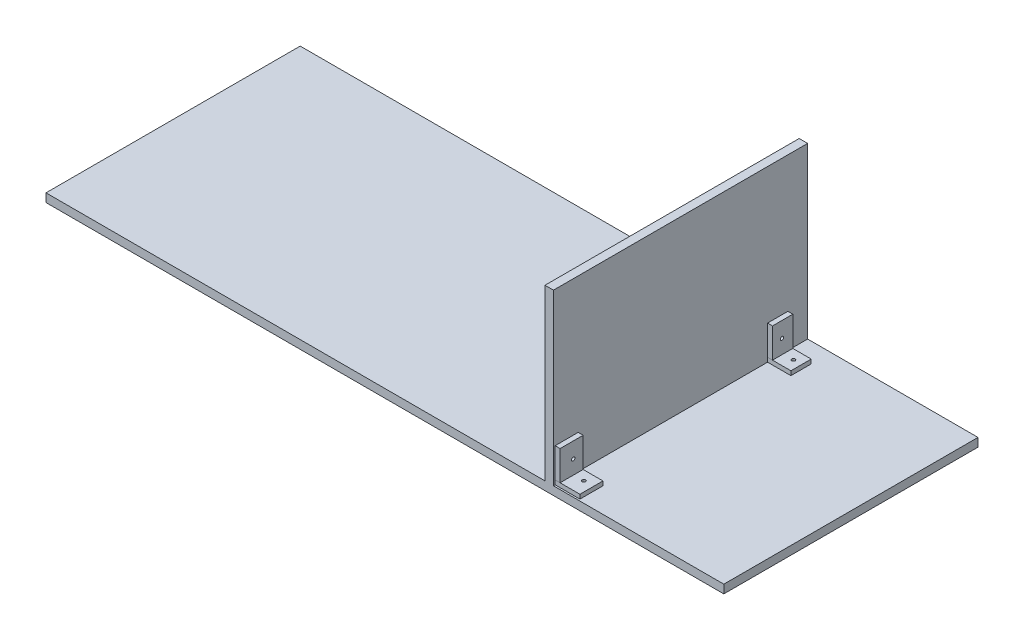
ISO-10303-21;
HEADER;
FILE_DESCRIPTION(('STEP AP214'),'2;1');
FILE_NAME('part.step','',(''),(''),'','','');
FILE_SCHEMA(('AUTOMOTIVE_DESIGN { 1 0 10303 214 1 1 1 1 }'));
ENDSEC;
DATA;
#1=APPLICATION_CONTEXT('core data for automotive mechanical design processes');
#2=APPLICATION_PROTOCOL_DEFINITION('international standard','automotive_design',2000,#1);
#3=PRODUCT_CONTEXT('',#1,'mechanical');
#4=PRODUCT('Part','Part','',(#3));
#5=PRODUCT_RELATED_PRODUCT_CATEGORY('part','',(#4));
#6=PRODUCT_DEFINITION_FORMATION('','',#4);
#7=PRODUCT_DEFINITION_CONTEXT('part definition',#1,'design');
#8=PRODUCT_DEFINITION('design','',#6,#7);
#9=PRODUCT_DEFINITION_SHAPE('','',#8);
#10=(LENGTH_UNIT() NAMED_UNIT(*) SI_UNIT(.MILLI.,.METRE.));
#11=(NAMED_UNIT(*) PLANE_ANGLE_UNIT() SI_UNIT($,.RADIAN.));
#12=(NAMED_UNIT(*) SI_UNIT($,.STERADIAN.) SOLID_ANGLE_UNIT());
#13=UNCERTAINTY_MEASURE_WITH_UNIT(LENGTH_MEASURE(1.E-05),#10,'distance_accuracy_value','');
#14=(GEOMETRIC_REPRESENTATION_CONTEXT(3) GLOBAL_UNCERTAINTY_ASSIGNED_CONTEXT((#13)) GLOBAL_UNIT_ASSIGNED_CONTEXT((#10,
#11,#12)) REPRESENTATION_CONTEXT('',''));
#15=CARTESIAN_POINT('',(0.,0.,0.));
#16=DIRECTION('',(0.,0.,1.));
#17=DIRECTION('',(1.,0.,0.));
#18=AXIS2_PLACEMENT_3D('',#15,#16,#17);
#19=CARTESIAN_POINT('',(-36.5676342908523,50.,-114.279683456061));
#20=DIRECTION('',(1.,0.,0.));
#21=DIRECTION('',(0.,0.,-1.));
#22=AXIS2_PLACEMENT_3D('',#19,#20,#21);
#23=PLANE('',#22);
#24=CARTESIAN_POINT('',(-36.5676342908523,31.6172761758651,-125.47551964991));
#25=DIRECTION('',(1.,0.,0.));
#26=DIRECTION('',(0.,0.,-1.));
#27=AXIS2_PLACEMENT_3D('',#24,#25,#26);
#28=CIRCLE('',#27,1.99999999999991);
#29=CARTESIAN_POINT('',(-36.5676342908523,31.6172761758651,-127.47551964991));
#30=VERTEX_POINT('',#29);
#31=EDGE_CURVE('E110',#30,#30,#28,.T.);
#32=ORIENTED_EDGE('',*,*,#31,.T.);
#33=EDGE_LOOP('',(#32));
#34=FACE_BOUND('',#33,.T.);
#35=DIRECTION('',(0.,0.,1.));
#36=VECTOR('',#35,1.);
#37=CARTESIAN_POINT('',(-36.5676342908523,15.,-114.279683456061));
#38=LINE('',#37,#36);
#39=CARTESIAN_POINT('',(-36.5676342908523,15.,-138.223579020959));
#40=VERTEX_POINT('',#39);
#41=CARTESIAN_POINT('',(-36.5676342908523,15.,-114.279683456061));
#42=VERTEX_POINT('',#41);
#43=EDGE_CURVE('E107',#40,#42,#38,.T.);
#44=ORIENTED_EDGE('',*,*,#43,.T.);
#45=DIRECTION('',(0.,-1.,0.));
#46=VECTOR('',#45,1.);
#47=CARTESIAN_POINT('',(-36.5676342908523,50.,-114.279683456061));
#48=LINE('',#47,#46);
#49=CARTESIAN_POINT('',(-36.5676342908523,50.,-114.279683456061));
#50=VERTEX_POINT('',#49);
#51=EDGE_CURVE('E12',#50,#42,#48,.T.);
#52=ORIENTED_EDGE('',*,*,#51,.F.);
#53=DIRECTION('',(0.,0.,1.));
#54=VECTOR('',#53,1.);
#55=CARTESIAN_POINT('',(-36.5676342908523,50.,-114.279683456061));
#56=LINE('',#55,#54);
#57=CARTESIAN_POINT('',(-36.5676342908523,50.,-138.223579020959));
#58=VERTEX_POINT('',#57);
#59=EDGE_CURVE('E95',#58,#50,#56,.T.);
#60=ORIENTED_EDGE('',*,*,#59,.F.);
#61=DIRECTION('',(0.,-1.,0.));
#62=VECTOR('',#61,1.);
#63=CARTESIAN_POINT('',(-36.5676342908523,50.,-138.223579020959));
#64=LINE('',#63,#62);
#65=EDGE_CURVE('E103',#58,#40,#64,.T.);
#66=ORIENTED_EDGE('',*,*,#65,.T.);
#67=EDGE_LOOP('',(#44,#52,#60,#66));
#68=FACE_BOUND('',#67,.T.);
#69=ADVANCED_FACE('F44',(#34,#68),#23,.F.);
#70=CARTESIAN_POINT('',(-36.5676342908523,50.,-114.279683456061));
#71=DIRECTION('',(0.,0.,-1.));
#72=DIRECTION('',(-1.,0.,0.));
#73=AXIS2_PLACEMENT_3D('',#70,#71,#72);
#74=PLANE('',#73);
#75=DIRECTION('',(1.,0.,0.));
#76=VECTOR('',#75,1.);
#77=CARTESIAN_POINT('',(-36.5676342908523,15.,-114.279683456061));
#78=LINE('',#77,#76);
#79=CARTESIAN_POINT('',(-30.7388499597323,15.,-114.279683456061));
#80=VERTEX_POINT('',#79);
#81=EDGE_CURVE('E99',#42,#80,#78,.T.);
#82=ORIENTED_EDGE('',*,*,#81,.T.);
#83=DIRECTION('',(0.,-1.,0.));
#84=VECTOR('',#83,1.);
#85=CARTESIAN_POINT('',(-30.7388499597323,50.,-114.279683456061));
#86=LINE('',#85,#84);
#87=CARTESIAN_POINT('',(-30.7388499597323,50.,-114.279683456061));
#88=VERTEX_POINT('',#87);
#89=EDGE_CURVE('E52',#88,#80,#86,.T.);
#90=ORIENTED_EDGE('',*,*,#89,.F.);
#91=DIRECTION('',(1.,0.,0.));
#92=VECTOR('',#91,1.);
#93=CARTESIAN_POINT('',(-36.5676342908523,50.,-114.279683456061));
#94=LINE('',#93,#92);
#95=EDGE_CURVE('E90',#50,#88,#94,.T.);
#96=ORIENTED_EDGE('',*,*,#95,.F.);
#97=ORIENTED_EDGE('',*,*,#51,.T.);
#98=EDGE_LOOP('',(#82,#90,#96,#97));
#99=FACE_BOUND('',#98,.T.);
#100=ADVANCED_FACE('F98',(#99),#74,.F.);
#101=CARTESIAN_POINT('',(-30.7388499597323,50.,-114.279683456061));
#102=DIRECTION('',(-1.,0.,0.));
#103=DIRECTION('',(0.,0.,1.));
#104=AXIS2_PLACEMENT_3D('',#101,#102,#103);
#105=PLANE('',#104);
#106=CARTESIAN_POINT('',(-30.7388499597323,31.6172761758651,-125.47551964991));
#107=DIRECTION('',(1.,0.,0.));
#108=DIRECTION('',(0.,0.,-1.));
#109=AXIS2_PLACEMENT_3D('',#106,#107,#108);
#110=CIRCLE('',#109,1.99999999999999);
#111=CARTESIAN_POINT('',(-30.7388499597323,31.6172761758651,-127.47551964991));
#112=VERTEX_POINT('',#111);
#113=EDGE_CURVE('E123',#112,#112,#110,.T.);
#114=ORIENTED_EDGE('',*,*,#113,.F.);
#115=EDGE_LOOP('',(#114));
#116=FACE_BOUND('',#115,.T.);
#117=DIRECTION('',(0.,0.,-1.));
#118=VECTOR('',#117,1.);
#119=CARTESIAN_POINT('',(-30.7388499597323,15.,-114.279683456061));
#120=LINE('',#119,#118);
#121=CARTESIAN_POINT('',(-30.7388499597323,15.,-138.223579020959));
#122=VERTEX_POINT('',#121);
#123=EDGE_CURVE('E77',#80,#122,#120,.T.);
#124=ORIENTED_EDGE('',*,*,#123,.T.);
#125=DIRECTION('',(0.,-1.,0.));
#126=VECTOR('',#125,1.);
#127=CARTESIAN_POINT('',(-30.7388499597323,50.,-138.223579020959));
#128=LINE('',#127,#126);
#129=CARTESIAN_POINT('',(-30.7388499597323,50.,-138.223579020959));
#130=VERTEX_POINT('',#129);
#131=EDGE_CURVE('E100',#130,#122,#128,.T.);
#132=ORIENTED_EDGE('',*,*,#131,.F.);
#133=DIRECTION('',(0.,0.,-1.));
#134=VECTOR('',#133,1.);
#135=CARTESIAN_POINT('',(-30.7388499597323,50.,-114.279683456061));
#136=LINE('',#135,#134);
#137=EDGE_CURVE('E93',#88,#130,#136,.T.);
#138=ORIENTED_EDGE('',*,*,#137,.F.);
#139=ORIENTED_EDGE('',*,*,#89,.T.);
#140=EDGE_LOOP('',(#124,#132,#138,#139));
#141=FACE_BOUND('',#140,.T.);
#142=ADVANCED_FACE('F101',(#116,#141),#105,.F.);
#143=CARTESIAN_POINT('',(-36.5676342908523,50.,-138.223579020959));
#144=DIRECTION('',(0.,0.,1.));
#145=DIRECTION('',(1.,0.,0.));
#146=AXIS2_PLACEMENT_3D('',#143,#144,#145);
#147=PLANE('',#146);
#148=DIRECTION('',(-1.,0.,0.));
#149=VECTOR('',#148,1.);
#150=CARTESIAN_POINT('',(-36.5676342908523,15.,-138.223579020959));
#151=LINE('',#150,#149);
#152=EDGE_CURVE('E83',#122,#40,#151,.T.);
#153=ORIENTED_EDGE('',*,*,#152,.T.);
#154=ORIENTED_EDGE('',*,*,#65,.F.);
#155=DIRECTION('',(-1.,0.,0.));
#156=VECTOR('',#155,1.);
#157=CARTESIAN_POINT('',(-36.5676342908523,50.,-138.223579020959));
#158=LINE('',#157,#156);
#159=EDGE_CURVE('E60',#130,#58,#158,.T.);
#160=ORIENTED_EDGE('',*,*,#159,.F.);
#161=ORIENTED_EDGE('',*,*,#131,.T.);
#162=EDGE_LOOP('',(#153,#154,#160,#161));
#163=FACE_BOUND('',#162,.T.);
#164=ADVANCED_FACE('F115',(#163),#147,.F.);
#165=CARTESIAN_POINT('',(0.,50.,0.));
#166=DIRECTION('',(0.,-1.,0.));
#167=DIRECTION('',(0.,0.,-1.));
#168=AXIS2_PLACEMENT_3D('',#165,#166,#167);
#169=PLANE('',#168);
#170=ORIENTED_EDGE('',*,*,#59,.T.);
#171=ORIENTED_EDGE('',*,*,#95,.T.);
#172=ORIENTED_EDGE('',*,*,#137,.T.);
#173=ORIENTED_EDGE('',*,*,#159,.T.);
#174=EDGE_LOOP('',(#170,#171,#172,#173));
#175=FACE_BOUND('',#174,.T.);
#176=ADVANCED_FACE('F91',(#175),#169,.F.);
#177=CARTESIAN_POINT('',(0.,15.,0.));
#178=DIRECTION('',(0.,-1.,0.));
#179=DIRECTION('',(0.,0.,-1.));
#180=AXIS2_PLACEMENT_3D('',#177,#178,#179);
#181=PLANE('',#180);
#182=ORIENTED_EDGE('',*,*,#43,.F.);
#183=ORIENTED_EDGE('',*,*,#152,.F.);
#184=ORIENTED_EDGE('',*,*,#123,.F.);
#185=ORIENTED_EDGE('',*,*,#81,.F.);
#186=EDGE_LOOP('',(#182,#183,#184,#185));
#187=FACE_BOUND('',#186,.T.);
#188=ADVANCED_FACE('F118',(#187),#181,.T.);
#189=CARTESIAN_POINT('',(-30.7388499597323,31.6172761758651,-125.47551964991));
#190=DIRECTION('',(1.,0.,0.));
#191=DIRECTION('',(0.,0.,-1.));
#192=AXIS2_PLACEMENT_3D('',#189,#190,#191);
#193=CYLINDRICAL_SURFACE('',#192,1.99999999999991);
#194=ORIENTED_EDGE('',*,*,#113,.T.);
#195=EDGE_LOOP('',(#194));
#196=FACE_BOUND('',#195,.T.);
#197=ORIENTED_EDGE('',*,*,#31,.F.);
#198=EDGE_LOOP('',(#197));
#199=FACE_BOUND('',#198,.T.);
#200=ADVANCED_FACE('F127',(#196,#199),#193,.F.);
#201=CLOSED_SHELL('',(#69,#100,#142,#164,#176,#188,#200));
#202=MANIFOLD_SOLID_BREP('B2',#201);
#203=CARTESIAN_POINT('',(-36.5676342908523,50.,136.415393086125));
#204=DIRECTION('',(1.,0.,0.));
#205=DIRECTION('',(0.,0.,-1.));
#206=AXIS2_PLACEMENT_3D('',#203,#204,#205);
#207=PLANE('',#206);
#208=CARTESIAN_POINT('',(-36.5676342908523,31.6172761758651,120.917654542936));
#209=DIRECTION('',(1.,0.,0.));
#210=DIRECTION('',(0.,0.,-1.));
#211=AXIS2_PLACEMENT_3D('',#208,#209,#210);
#212=CIRCLE('',#211,1.99999999999991);
#213=CARTESIAN_POINT('',(-36.5676342908523,31.6172761758651,118.917654542936));
#214=VERTEX_POINT('',#213);
#215=EDGE_CURVE('E265',#214,#214,#212,.T.);
#216=ORIENTED_EDGE('',*,*,#215,.T.);
#217=EDGE_LOOP('',(#216));
#218=FACE_BOUND('',#217,.T.);
#219=DIRECTION('',(0.,0.,1.));
#220=VECTOR('',#219,1.);
#221=CARTESIAN_POINT('',(-36.5676342908523,15.,136.415393086125));
#222=LINE('',#221,#220);
#223=CARTESIAN_POINT('',(-36.5676342908523,15.,109.22857214905));
#224=VERTEX_POINT('',#223);
#225=CARTESIAN_POINT('',(-36.5676342908523,15.,136.415393086125));
#226=VERTEX_POINT('',#225);
#227=EDGE_CURVE('E262',#224,#226,#222,.T.);
#228=ORIENTED_EDGE('',*,*,#227,.T.);
#229=DIRECTION('',(0.,-1.,0.));
#230=VECTOR('',#229,1.);
#231=CARTESIAN_POINT('',(-36.5676342908523,50.,136.415393086125));
#232=LINE('',#231,#230);
#233=CARTESIAN_POINT('',(-36.5676342908523,50.,136.415393086125));
#234=VERTEX_POINT('',#233);
#235=EDGE_CURVE('E42',#234,#226,#232,.T.);
#236=ORIENTED_EDGE('',*,*,#235,.F.);
#237=DIRECTION('',(0.,0.,1.));
#238=VECTOR('',#237,1.);
#239=CARTESIAN_POINT('',(-36.5676342908523,50.,136.415393086125));
#240=LINE('',#239,#238);
#241=CARTESIAN_POINT('',(-36.5676342908523,50.,109.22857214905));
#242=VERTEX_POINT('',#241);
#243=EDGE_CURVE('E250',#242,#234,#240,.T.);
#244=ORIENTED_EDGE('',*,*,#243,.F.);
#245=DIRECTION('',(0.,-1.,0.));
#246=VECTOR('',#245,1.);
#247=CARTESIAN_POINT('',(-36.5676342908523,50.,109.22857214905));
#248=LINE('',#247,#246);
#249=EDGE_CURVE('E258',#242,#224,#248,.T.);
#250=ORIENTED_EDGE('',*,*,#249,.T.);
#251=EDGE_LOOP('',(#228,#236,#244,#250));
#252=FACE_BOUND('',#251,.T.);
#253=ADVANCED_FACE('F199',(#218,#252),#207,.F.);
#254=CARTESIAN_POINT('',(-36.5676342908523,50.,136.415393086125));
#255=DIRECTION('',(0.,0.,-1.));
#256=DIRECTION('',(-1.,0.,0.));
#257=AXIS2_PLACEMENT_3D('',#254,#255,#256);
#258=PLANE('',#257);
#259=DIRECTION('',(1.,0.,0.));
#260=VECTOR('',#259,1.);
#261=CARTESIAN_POINT('',(-36.5676342908523,15.,136.415393086125));
#262=LINE('',#261,#260);
#263=CARTESIAN_POINT('',(-30.7388499597323,15.,136.415393086125));
#264=VERTEX_POINT('',#263);
#265=EDGE_CURVE('E254',#226,#264,#262,.T.);
#266=ORIENTED_EDGE('',*,*,#265,.T.);
#267=DIRECTION('',(0.,-1.,0.));
#268=VECTOR('',#267,1.);
#269=CARTESIAN_POINT('',(-30.7388499597323,50.,136.415393086125));
#270=LINE('',#269,#268);
#271=CARTESIAN_POINT('',(-30.7388499597323,50.,136.415393086125));
#272=VERTEX_POINT('',#271);
#273=EDGE_CURVE('E207',#272,#264,#270,.T.);
#274=ORIENTED_EDGE('',*,*,#273,.F.);
#275=DIRECTION('',(1.,0.,0.));
#276=VECTOR('',#275,1.);
#277=CARTESIAN_POINT('',(-36.5676342908523,50.,136.415393086125));
#278=LINE('',#277,#276);
#279=EDGE_CURVE('E245',#234,#272,#278,.T.);
#280=ORIENTED_EDGE('',*,*,#279,.F.);
#281=ORIENTED_EDGE('',*,*,#235,.T.);
#282=EDGE_LOOP('',(#266,#274,#280,#281));
#283=FACE_BOUND('',#282,.T.);
#284=ADVANCED_FACE('F253',(#283),#258,.F.);
#285=CARTESIAN_POINT('',(-30.7388499597323,50.,136.415393086125));
#286=DIRECTION('',(-1.,0.,0.));
#287=DIRECTION('',(0.,0.,1.));
#288=AXIS2_PLACEMENT_3D('',#285,#286,#287);
#289=PLANE('',#288);
#290=CARTESIAN_POINT('',(-30.7388499597323,31.6172761758651,120.917654542936));
#291=DIRECTION('',(1.,0.,0.));
#292=DIRECTION('',(0.,0.,-1.));
#293=AXIS2_PLACEMENT_3D('',#290,#291,#292);
#294=CIRCLE('',#293,1.99999999999999);
#295=CARTESIAN_POINT('',(-30.7388499597323,31.6172761758651,118.917654542936));
#296=VERTEX_POINT('',#295);
#297=EDGE_CURVE('E278',#296,#296,#294,.T.);
#298=ORIENTED_EDGE('',*,*,#297,.F.);
#299=EDGE_LOOP('',(#298));
#300=FACE_BOUND('',#299,.T.);
#301=DIRECTION('',(0.,0.,-1.));
#302=VECTOR('',#301,1.);
#303=CARTESIAN_POINT('',(-30.7388499597323,15.,136.415393086125));
#304=LINE('',#303,#302);
#305=CARTESIAN_POINT('',(-30.7388499597323,15.,109.22857214905));
#306=VERTEX_POINT('',#305);
#307=EDGE_CURVE('E232',#264,#306,#304,.T.);
#308=ORIENTED_EDGE('',*,*,#307,.T.);
#309=DIRECTION('',(0.,-1.,0.));
#310=VECTOR('',#309,1.);
#311=CARTESIAN_POINT('',(-30.7388499597323,50.,109.22857214905));
#312=LINE('',#311,#310);
#313=CARTESIAN_POINT('',(-30.7388499597323,50.,109.22857214905));
#314=VERTEX_POINT('',#313);
#315=EDGE_CURVE('E255',#314,#306,#312,.T.);
#316=ORIENTED_EDGE('',*,*,#315,.F.);
#317=DIRECTION('',(0.,0.,-1.));
#318=VECTOR('',#317,1.);
#319=CARTESIAN_POINT('',(-30.7388499597323,50.,136.415393086125));
#320=LINE('',#319,#318);
#321=EDGE_CURVE('E248',#272,#314,#320,.T.);
#322=ORIENTED_EDGE('',*,*,#321,.F.);
#323=ORIENTED_EDGE('',*,*,#273,.T.);
#324=EDGE_LOOP('',(#308,#316,#322,#323));
#325=FACE_BOUND('',#324,.T.);
#326=ADVANCED_FACE('F256',(#300,#325),#289,.F.);
#327=CARTESIAN_POINT('',(-36.5676342908523,50.,109.22857214905));
#328=DIRECTION('',(0.,0.,1.));
#329=DIRECTION('',(1.,0.,0.));
#330=AXIS2_PLACEMENT_3D('',#327,#328,#329);
#331=PLANE('',#330);
#332=DIRECTION('',(-1.,0.,0.));
#333=VECTOR('',#332,1.);
#334=CARTESIAN_POINT('',(-36.5676342908523,15.,109.22857214905));
#335=LINE('',#334,#333);
#336=EDGE_CURVE('E238',#306,#224,#335,.T.);
#337=ORIENTED_EDGE('',*,*,#336,.T.);
#338=ORIENTED_EDGE('',*,*,#249,.F.);
#339=DIRECTION('',(-1.,0.,0.));
#340=VECTOR('',#339,1.);
#341=CARTESIAN_POINT('',(-36.5676342908523,50.,109.22857214905));
#342=LINE('',#341,#340);
#343=EDGE_CURVE('E215',#314,#242,#342,.T.);
#344=ORIENTED_EDGE('',*,*,#343,.F.);
#345=ORIENTED_EDGE('',*,*,#315,.T.);
#346=EDGE_LOOP('',(#337,#338,#344,#345));
#347=FACE_BOUND('',#346,.T.);
#348=ADVANCED_FACE('F270',(#347),#331,.F.);
#349=CARTESIAN_POINT('',(0.,50.,0.));
#350=DIRECTION('',(0.,-1.,0.));
#351=DIRECTION('',(0.,0.,-1.));
#352=AXIS2_PLACEMENT_3D('',#349,#350,#351);
#353=PLANE('',#352);
#354=ORIENTED_EDGE('',*,*,#243,.T.);
#355=ORIENTED_EDGE('',*,*,#279,.T.);
#356=ORIENTED_EDGE('',*,*,#321,.T.);
#357=ORIENTED_EDGE('',*,*,#343,.T.);
#358=EDGE_LOOP('',(#354,#355,#356,#357));
#359=FACE_BOUND('',#358,.T.);
#360=ADVANCED_FACE('F246',(#359),#353,.F.);
#361=CARTESIAN_POINT('',(0.,15.,0.));
#362=DIRECTION('',(0.,-1.,0.));
#363=DIRECTION('',(0.,0.,-1.));
#364=AXIS2_PLACEMENT_3D('',#361,#362,#363);
#365=PLANE('',#364);
#366=ORIENTED_EDGE('',*,*,#227,.F.);
#367=ORIENTED_EDGE('',*,*,#336,.F.);
#368=ORIENTED_EDGE('',*,*,#307,.F.);
#369=ORIENTED_EDGE('',*,*,#265,.F.);
#370=EDGE_LOOP('',(#366,#367,#368,#369));
#371=FACE_BOUND('',#370,.T.);
#372=ADVANCED_FACE('F273',(#371),#365,.T.);
#373=CARTESIAN_POINT('',(-30.7388499597323,31.6172761758651,120.917654542936));
#374=DIRECTION('',(1.,0.,0.));
#375=DIRECTION('',(0.,0.,-1.));
#376=AXIS2_PLACEMENT_3D('',#373,#374,#375);
#377=CYLINDRICAL_SURFACE('',#376,1.99999999999991);
#378=ORIENTED_EDGE('',*,*,#297,.T.);
#379=EDGE_LOOP('',(#378));
#380=FACE_BOUND('',#379,.T.);
#381=ORIENTED_EDGE('',*,*,#215,.F.);
#382=EDGE_LOOP('',(#381));
#383=FACE_BOUND('',#382,.T.);
#384=ADVANCED_FACE('F282',(#380,#383),#377,.F.);
#385=CLOSED_SHELL('',(#253,#284,#326,#348,#360,#372,#384));
#386=MANIFOLD_SOLID_BREP('B6',#385);
#387=CARTESIAN_POINT('',(-9.03405457172823,15.,-114.279683456061));
#388=DIRECTION('',(-1.,0.,0.));
#389=DIRECTION('',(0.,0.,1.));
#390=AXIS2_PLACEMENT_3D('',#387,#388,#389);
#391=PLANE('',#390);
#392=DIRECTION('',(0.,0.,-1.));
#393=VECTOR('',#392,1.);
#394=CARTESIAN_POINT('',(-9.03405457172823,10.,-114.279683456061));
#395=LINE('',#394,#393);
#396=CARTESIAN_POINT('',(-9.03405457172823,10.,-114.279683456061));
#397=VERTEX_POINT('',#396);
#398=CARTESIAN_POINT('',(-9.03405457172823,10.,-138.223579020959));
#399=VERTEX_POINT('',#398);
#400=EDGE_CURVE('E417',#397,#399,#395,.T.);
#401=ORIENTED_EDGE('',*,*,#400,.T.);
#402=DIRECTION('',(0.,-1.,0.));
#403=VECTOR('',#402,1.);
#404=CARTESIAN_POINT('',(-9.03405457172823,15.,-138.223579020959));
#405=LINE('',#404,#403);
#406=CARTESIAN_POINT('',(-9.03405457172823,15.,-138.223579020959));
#407=VERTEX_POINT('',#406);
#408=EDGE_CURVE('E197',#407,#399,#405,.T.);
#409=ORIENTED_EDGE('',*,*,#408,.F.);
#410=DIRECTION('',(0.,0.,-1.));
#411=VECTOR('',#410,1.);
#412=CARTESIAN_POINT('',(-9.03405457172823,15.,-114.279683456061));
#413=LINE('',#412,#411);
#414=CARTESIAN_POINT('',(-9.03405457172823,15.,-114.279683456061));
#415=VERTEX_POINT('',#414);
#416=EDGE_CURVE('E405',#415,#407,#413,.T.);
#417=ORIENTED_EDGE('',*,*,#416,.F.);
#418=DIRECTION('',(0.,-1.,0.));
#419=VECTOR('',#418,1.);
#420=CARTESIAN_POINT('',(-9.03405457172823,15.,-114.279683456061));
#421=LINE('',#420,#419);
#422=EDGE_CURVE('E413',#415,#397,#421,.T.);
#423=ORIENTED_EDGE('',*,*,#422,.T.);
#424=EDGE_LOOP('',(#401,#409,#417,#423));
#425=FACE_BOUND('',#424,.T.);
#426=ADVANCED_FACE('F354',(#425),#391,.F.);
#427=CARTESIAN_POINT('',(-9.03405457172823,15.,-138.223579020959));
#428=DIRECTION('',(0.,0.,1.));
#429=DIRECTION('',(1.,0.,0.));
#430=AXIS2_PLACEMENT_3D('',#427,#428,#429);
#431=PLANE('',#430);
#432=DIRECTION('',(-1.,0.,0.));
#433=VECTOR('',#432,1.);
#434=CARTESIAN_POINT('',(-9.03405457172823,10.,-138.223579020959));
#435=LINE('',#434,#433);
#436=CARTESIAN_POINT('',(-36.5676342908523,10.,-138.223579020959));
#437=VERTEX_POINT('',#436);
#438=EDGE_CURVE('E409',#399,#437,#435,.T.);
#439=ORIENTED_EDGE('',*,*,#438,.T.);
#440=DIRECTION('',(0.,-1.,0.));
#441=VECTOR('',#440,1.);
#442=CARTESIAN_POINT('',(-36.5676342908523,15.,-138.223579020959));
#443=LINE('',#442,#441);
#444=CARTESIAN_POINT('',(-36.5676342908523,15.,-138.223579020959));
#445=VERTEX_POINT('',#444);
#446=EDGE_CURVE('E362',#445,#437,#443,.T.);
#447=ORIENTED_EDGE('',*,*,#446,.F.);
#448=DIRECTION('',(-1.,0.,0.));
#449=VECTOR('',#448,1.);
#450=CARTESIAN_POINT('',(-9.03405457172823,15.,-138.223579020959));
#451=LINE('',#450,#449);
#452=EDGE_CURVE('E400',#407,#445,#451,.T.);
#453=ORIENTED_EDGE('',*,*,#452,.F.);
#454=ORIENTED_EDGE('',*,*,#408,.T.);
#455=EDGE_LOOP('',(#439,#447,#453,#454));
#456=FACE_BOUND('',#455,.T.);
#457=ADVANCED_FACE('F408',(#456),#431,.F.);
#458=CARTESIAN_POINT('',(-36.5676342908523,15.,-114.279683456061));
#459=DIRECTION('',(1.,0.,0.));
#460=DIRECTION('',(0.,0.,-1.));
#461=AXIS2_PLACEMENT_3D('',#458,#459,#460);
#462=PLANE('',#461);
#463=DIRECTION('',(0.,0.,1.));
#464=VECTOR('',#463,1.);
#465=CARTESIAN_POINT('',(-36.5676342908523,10.,-114.279683456061));
#466=LINE('',#465,#464);
#467=CARTESIAN_POINT('',(-36.5676342908523,10.,-114.279683456061));
#468=VERTEX_POINT('',#467);
#469=EDGE_CURVE('E387',#437,#468,#466,.T.);
#470=ORIENTED_EDGE('',*,*,#469,.T.);
#471=DIRECTION('',(0.,-1.,0.));
#472=VECTOR('',#471,1.);
#473=CARTESIAN_POINT('',(-36.5676342908523,15.,-114.279683456061));
#474=LINE('',#473,#472);
#475=CARTESIAN_POINT('',(-36.5676342908523,15.,-114.279683456061));
#476=VERTEX_POINT('',#475);
#477=EDGE_CURVE('E410',#476,#468,#474,.T.);
#478=ORIENTED_EDGE('',*,*,#477,.F.);
#479=DIRECTION('',(0.,0.,1.));
#480=VECTOR('',#479,1.);
#481=CARTESIAN_POINT('',(-36.5676342908523,15.,-114.279683456061));
#482=LINE('',#481,#480);
#483=EDGE_CURVE('E403',#445,#476,#482,.T.);
#484=ORIENTED_EDGE('',*,*,#483,.F.);
#485=ORIENTED_EDGE('',*,*,#446,.T.);
#486=EDGE_LOOP('',(#470,#478,#484,#485));
#487=FACE_BOUND('',#486,.T.);
#488=ADVANCED_FACE('F411',(#487),#462,.F.);
#489=CARTESIAN_POINT('',(-9.03405457172823,15.,-114.279683456061));
#490=DIRECTION('',(0.,0.,-1.));
#491=DIRECTION('',(-1.,0.,0.));
#492=AXIS2_PLACEMENT_3D('',#489,#490,#491);
#493=PLANE('',#492);
#494=DIRECTION('',(1.,0.,0.));
#495=VECTOR('',#494,1.);
#496=CARTESIAN_POINT('',(-9.03405457172823,10.,-114.279683456061));
#497=LINE('',#496,#495);
#498=EDGE_CURVE('E393',#468,#397,#497,.T.);
#499=ORIENTED_EDGE('',*,*,#498,.T.);
#500=ORIENTED_EDGE('',*,*,#422,.F.);
#501=DIRECTION('',(1.,0.,0.));
#502=VECTOR('',#501,1.);
#503=CARTESIAN_POINT('',(-9.03405457172823,15.,-114.279683456061));
#504=LINE('',#503,#502);
#505=EDGE_CURVE('E370',#476,#415,#504,.T.);
#506=ORIENTED_EDGE('',*,*,#505,.F.);
#507=ORIENTED_EDGE('',*,*,#477,.T.);
#508=EDGE_LOOP('',(#499,#500,#506,#507));
#509=FACE_BOUND('',#508,.T.);
#510=ADVANCED_FACE('F425',(#509),#493,.F.);
#511=CARTESIAN_POINT('',(0.,15.,0.));
#512=DIRECTION('',(0.,1.,0.));
#513=DIRECTION('',(0.,0.,1.));
#514=AXIS2_PLACEMENT_3D('',#511,#512,#513);
#515=PLANE('',#514);
#516=CARTESIAN_POINT('',(-18.6879904818511,15.,-126.915842267806));
#517=DIRECTION('',(0.,1.,0.));
#518=DIRECTION('',(0.,0.,1.));
#519=AXIS2_PLACEMENT_3D('',#516,#517,#518);
#520=CIRCLE('',#519,2.);
#521=CARTESIAN_POINT('',(-18.6879904818511,15.,-124.915842267806));
#522=VERTEX_POINT('',#521);
#523=EDGE_CURVE('E433',#522,#522,#520,.T.);
#524=ORIENTED_EDGE('',*,*,#523,.F.);
#525=EDGE_LOOP('',(#524));
#526=FACE_BOUND('',#525,.T.);
#527=ORIENTED_EDGE('',*,*,#416,.T.);
#528=ORIENTED_EDGE('',*,*,#452,.T.);
#529=ORIENTED_EDGE('',*,*,#483,.T.);
#530=ORIENTED_EDGE('',*,*,#505,.T.);
#531=EDGE_LOOP('',(#527,#528,#529,#530));
#532=FACE_BOUND('',#531,.T.);
#533=ADVANCED_FACE('F401',(#526,#532),#515,.T.);
#534=CARTESIAN_POINT('',(0.,10.,0.));
#535=DIRECTION('',(0.,1.,0.));
#536=DIRECTION('',(0.,0.,1.));
#537=AXIS2_PLACEMENT_3D('',#534,#535,#536);
#538=PLANE('',#537);
#539=CARTESIAN_POINT('',(-18.6879904818511,10.,-126.915842267806));
#540=DIRECTION('',(0.,1.,0.));
#541=DIRECTION('',(0.,0.,1.));
#542=AXIS2_PLACEMENT_3D('',#539,#540,#541);
#543=CIRCLE('',#542,2.);
#544=CARTESIAN_POINT('',(-18.6879904818511,10.,-124.915842267806));
#545=VERTEX_POINT('',#544);
#546=EDGE_CURVE('E420',#545,#545,#543,.T.);
#547=ORIENTED_EDGE('',*,*,#546,.T.);
#548=EDGE_LOOP('',(#547));
#549=FACE_BOUND('',#548,.T.);
#550=ORIENTED_EDGE('',*,*,#400,.F.);
#551=ORIENTED_EDGE('',*,*,#498,.F.);
#552=ORIENTED_EDGE('',*,*,#469,.F.);
#553=ORIENTED_EDGE('',*,*,#438,.F.);
#554=EDGE_LOOP('',(#550,#551,#552,#553));
#555=FACE_BOUND('',#554,.T.);
#556=ADVANCED_FACE('F428',(#549,#555),#538,.F.);
#557=CARTESIAN_POINT('',(-18.6879904818511,15.,-126.915842267806));
#558=DIRECTION('',(0.,1.,0.));
#559=DIRECTION('',(0.,0.,1.));
#560=AXIS2_PLACEMENT_3D('',#557,#558,#559);
#561=CYLINDRICAL_SURFACE('',#560,2.);
#562=ORIENTED_EDGE('',*,*,#523,.T.);
#563=EDGE_LOOP('',(#562));
#564=FACE_BOUND('',#563,.T.);
#565=ORIENTED_EDGE('',*,*,#546,.F.);
#566=EDGE_LOOP('',(#565));
#567=FACE_BOUND('',#566,.T.);
#568=ADVANCED_FACE('F437',(#564,#567),#561,.F.);
#569=CLOSED_SHELL('',(#426,#457,#488,#510,#533,#556,#568));
#570=MANIFOLD_SOLID_BREP('B36',#569);
#571=CARTESIAN_POINT('',(-36.5676342908523,15.,109.22857214905));
#572=DIRECTION('',(1.,0.,0.));
#573=DIRECTION('',(0.,0.,-1.));
#574=AXIS2_PLACEMENT_3D('',#571,#572,#573);
#575=PLANE('',#574);
#576=DIRECTION('',(0.,0.,1.));
#577=VECTOR('',#576,1.);
#578=CARTESIAN_POINT('',(-36.5676342908523,10.,109.22857214905));
#579=LINE('',#578,#577);
#580=CARTESIAN_POINT('',(-36.5676342908523,10.,109.22857214905));
#581=VERTEX_POINT('',#580);
#582=CARTESIAN_POINT('',(-36.5676342908523,10.,136.415393086125));
#583=VERTEX_POINT('',#582);
#584=EDGE_CURVE('E571',#581,#583,#579,.T.);
#585=ORIENTED_EDGE('',*,*,#584,.T.);
#586=DIRECTION('',(0.,-1.,0.));
#587=VECTOR('',#586,1.);
#588=CARTESIAN_POINT('',(-36.5676342908523,15.,136.415393086125));
#589=LINE('',#588,#587);
#590=CARTESIAN_POINT('',(-36.5676342908523,15.,136.415393086125));
#591=VERTEX_POINT('',#590);
#592=EDGE_CURVE('E352',#591,#583,#589,.T.);
#593=ORIENTED_EDGE('',*,*,#592,.F.);
#594=DIRECTION('',(0.,0.,1.));
#595=VECTOR('',#594,1.);
#596=CARTESIAN_POINT('',(-36.5676342908523,15.,109.22857214905));
#597=LINE('',#596,#595);
#598=CARTESIAN_POINT('',(-36.5676342908523,15.,109.22857214905));
#599=VERTEX_POINT('',#598);
#600=EDGE_CURVE('E559',#599,#591,#597,.T.);
#601=ORIENTED_EDGE('',*,*,#600,.F.);
#602=DIRECTION('',(0.,-1.,0.));
#603=VECTOR('',#602,1.);
#604=CARTESIAN_POINT('',(-36.5676342908523,15.,109.22857214905));
#605=LINE('',#604,#603);
#606=EDGE_CURVE('E567',#599,#581,#605,.T.);
#607=ORIENTED_EDGE('',*,*,#606,.T.);
#608=EDGE_LOOP('',(#585,#593,#601,#607));
#609=FACE_BOUND('',#608,.T.);
#610=ADVANCED_FACE('F508',(#609),#575,.F.);
#611=CARTESIAN_POINT('',(-36.5676342908523,15.,136.415393086125));
#612=DIRECTION('',(0.,0.,-1.));
#613=DIRECTION('',(-1.,0.,0.));
#614=AXIS2_PLACEMENT_3D('',#611,#612,#613);
#615=PLANE('',#614);
#616=DIRECTION('',(1.,0.,0.));
#617=VECTOR('',#616,1.);
#618=CARTESIAN_POINT('',(-36.5676342908523,10.,136.415393086125));
#619=LINE('',#618,#617);
#620=CARTESIAN_POINT('',(-7.34355206279247,10.,136.415393086125));
#621=VERTEX_POINT('',#620);
#622=EDGE_CURVE('E563',#583,#621,#619,.T.);
#623=ORIENTED_EDGE('',*,*,#622,.T.);
#624=DIRECTION('',(0.,-1.,0.));
#625=VECTOR('',#624,1.);
#626=CARTESIAN_POINT('',(-7.34355206279247,15.,136.415393086125));
#627=LINE('',#626,#625);
#628=CARTESIAN_POINT('',(-7.34355206279247,15.,136.415393086125));
#629=VERTEX_POINT('',#628);
#630=EDGE_CURVE('E516',#629,#621,#627,.T.);
#631=ORIENTED_EDGE('',*,*,#630,.F.);
#632=DIRECTION('',(1.,0.,0.));
#633=VECTOR('',#632,1.);
#634=CARTESIAN_POINT('',(-36.5676342908523,15.,136.415393086125));
#635=LINE('',#634,#633);
#636=EDGE_CURVE('E554',#591,#629,#635,.T.);
#637=ORIENTED_EDGE('',*,*,#636,.F.);
#638=ORIENTED_EDGE('',*,*,#592,.T.);
#639=EDGE_LOOP('',(#623,#631,#637,#638));
#640=FACE_BOUND('',#639,.T.);
#641=ADVANCED_FACE('F562',(#640),#615,.F.);
#642=CARTESIAN_POINT('',(-7.34355206279248,15.,109.22857214905));
#643=DIRECTION('',(-1.,0.,0.));
#644=DIRECTION('',(0.,0.,1.));
#645=AXIS2_PLACEMENT_3D('',#642,#643,#644);
#646=PLANE('',#645);
#647=DIRECTION('',(0.,0.,-1.));
#648=VECTOR('',#647,1.);
#649=CARTESIAN_POINT('',(-7.34355206279248,10.,109.22857214905));
#650=LINE('',#649,#648);
#651=CARTESIAN_POINT('',(-7.34355206279248,10.,109.22857214905));
#652=VERTEX_POINT('',#651);
#653=EDGE_CURVE('E541',#621,#652,#650,.T.);
#654=ORIENTED_EDGE('',*,*,#653,.T.);
#655=DIRECTION('',(0.,-1.,0.));
#656=VECTOR('',#655,1.);
#657=CARTESIAN_POINT('',(-7.34355206279248,15.,109.22857214905));
#658=LINE('',#657,#656);
#659=CARTESIAN_POINT('',(-7.34355206279248,15.,109.22857214905));
#660=VERTEX_POINT('',#659);
#661=EDGE_CURVE('E564',#660,#652,#658,.T.);
#662=ORIENTED_EDGE('',*,*,#661,.F.);
#663=DIRECTION('',(0.,0.,-1.));
#664=VECTOR('',#663,1.);
#665=CARTESIAN_POINT('',(-7.34355206279248,15.,109.22857214905));
#666=LINE('',#665,#664);
#667=EDGE_CURVE('E557',#629,#660,#666,.T.);
#668=ORIENTED_EDGE('',*,*,#667,.F.);
#669=ORIENTED_EDGE('',*,*,#630,.T.);
#670=EDGE_LOOP('',(#654,#662,#668,#669));
#671=FACE_BOUND('',#670,.T.);
#672=ADVANCED_FACE('F565',(#671),#646,.F.);
#673=CARTESIAN_POINT('',(-36.5676342908523,15.,109.22857214905));
#674=DIRECTION('',(0.,0.,1.));
#675=DIRECTION('',(1.,0.,0.));
#676=AXIS2_PLACEMENT_3D('',#673,#674,#675);
#677=PLANE('',#676);
#678=DIRECTION('',(-1.,0.,0.));
#679=VECTOR('',#678,1.);
#680=CARTESIAN_POINT('',(-36.5676342908523,10.,109.22857214905));
#681=LINE('',#680,#679);
#682=EDGE_CURVE('E547',#652,#581,#681,.T.);
#683=ORIENTED_EDGE('',*,*,#682,.T.);
#684=ORIENTED_EDGE('',*,*,#606,.F.);
#685=DIRECTION('',(-1.,0.,0.));
#686=VECTOR('',#685,1.);
#687=CARTESIAN_POINT('',(-36.5676342908523,15.,109.22857214905));
#688=LINE('',#687,#686);
#689=EDGE_CURVE('E524',#660,#599,#688,.T.);
#690=ORIENTED_EDGE('',*,*,#689,.F.);
#691=ORIENTED_EDGE('',*,*,#661,.T.);
#692=EDGE_LOOP('',(#683,#684,#690,#691));
#693=FACE_BOUND('',#692,.T.);
#694=ADVANCED_FACE('F579',(#693),#677,.F.);
#695=CARTESIAN_POINT('',(0.,15.,0.));
#696=DIRECTION('',(0.,1.,0.));
#697=DIRECTION('',(0.,0.,1.));
#698=AXIS2_PLACEMENT_3D('',#695,#696,#697);
#699=PLANE('',#698);
#700=CARTESIAN_POINT('',(-18.6879904818511,15.,120.358746082161));
#701=DIRECTION('',(0.,1.,0.));
#702=DIRECTION('',(0.,0.,1.));
#703=AXIS2_PLACEMENT_3D('',#700,#701,#702);
#704=CIRCLE('',#703,2.);
#705=CARTESIAN_POINT('',(-18.6879904818511,15.,122.358746082161));
#706=VERTEX_POINT('',#705);
#707=EDGE_CURVE('E587',#706,#706,#704,.T.);
#708=ORIENTED_EDGE('',*,*,#707,.F.);
#709=EDGE_LOOP('',(#708));
#710=FACE_BOUND('',#709,.T.);
#711=ORIENTED_EDGE('',*,*,#600,.T.);
#712=ORIENTED_EDGE('',*,*,#636,.T.);
#713=ORIENTED_EDGE('',*,*,#667,.T.);
#714=ORIENTED_EDGE('',*,*,#689,.T.);
#715=EDGE_LOOP('',(#711,#712,#713,#714));
#716=FACE_BOUND('',#715,.T.);
#717=ADVANCED_FACE('F555',(#710,#716),#699,.T.);
#718=CARTESIAN_POINT('',(0.,10.,0.));
#719=DIRECTION('',(0.,1.,0.));
#720=DIRECTION('',(0.,0.,1.));
#721=AXIS2_PLACEMENT_3D('',#718,#719,#720);
#722=PLANE('',#721);
#723=CARTESIAN_POINT('',(-18.6879904818511,10.,120.358746082161));
#724=DIRECTION('',(0.,1.,0.));
#725=DIRECTION('',(0.,0.,1.));
#726=AXIS2_PLACEMENT_3D('',#723,#724,#725);
#727=CIRCLE('',#726,2.);
#728=CARTESIAN_POINT('',(-18.6879904818511,10.,122.358746082161));
#729=VERTEX_POINT('',#728);
#730=EDGE_CURVE('E574',#729,#729,#727,.T.);
#731=ORIENTED_EDGE('',*,*,#730,.T.);
#732=EDGE_LOOP('',(#731));
#733=FACE_BOUND('',#732,.T.);
#734=ORIENTED_EDGE('',*,*,#584,.F.);
#735=ORIENTED_EDGE('',*,*,#682,.F.);
#736=ORIENTED_EDGE('',*,*,#653,.F.);
#737=ORIENTED_EDGE('',*,*,#622,.F.);
#738=EDGE_LOOP('',(#734,#735,#736,#737));
#739=FACE_BOUND('',#738,.T.);
#740=ADVANCED_FACE('F582',(#733,#739),#722,.F.);
#741=CARTESIAN_POINT('',(-18.6879904818511,15.,120.358746082161));
#742=DIRECTION('',(0.,1.,0.));
#743=DIRECTION('',(0.,0.,1.));
#744=AXIS2_PLACEMENT_3D('',#741,#742,#743);
#745=CYLINDRICAL_SURFACE('',#744,2.);
#746=ORIENTED_EDGE('',*,*,#707,.T.);
#747=EDGE_LOOP('',(#746));
#748=FACE_BOUND('',#747,.T.);
#749=ORIENTED_EDGE('',*,*,#730,.F.);
#750=EDGE_LOOP('',(#749));
#751=FACE_BOUND('',#750,.T.);
#752=ADVANCED_FACE('F591',(#748,#751),#745,.F.);
#753=CLOSED_SHELL('',(#610,#641,#672,#694,#717,#740,#752));
#754=MANIFOLD_SOLID_BREP('B191',#753);
#755=CARTESIAN_POINT('',(0.,10.,0.));
#756=DIRECTION('',(0.,1.,0.));
#757=DIRECTION('',(0.,0.,1.));
#758=AXIS2_PLACEMENT_3D('',#755,#756,#757);
#759=PLANE('',#758);
#760=DIRECTION('',(0.,0.,1.));
#761=VECTOR('',#760,1.);
#762=CARTESIAN_POINT('',(-46.5676342908523,10.,-161.590855643783));
#763=LINE('',#762,#761);
#764=CARTESIAN_POINT('',(-46.5676342908523,10.,-161.590855643783));
#765=VERTEX_POINT('',#764);
#766=CARTESIAN_POINT('',(-46.5676342908523,10.,138.409144356217));
#767=VERTEX_POINT('',#766);
#768=EDGE_CURVE('E670',#765,#767,#763,.T.);
#769=ORIENTED_EDGE('',*,*,#768,.F.);
#770=DIRECTION('',(-1.,0.,0.));
#771=VECTOR('',#770,1.);
#772=CARTESIAN_POINT('',(-635.513382351834,10.,-161.590855643783));
#773=LINE('',#772,#771);
#774=CARTESIAN_POINT('',(-635.513382351834,10.,-161.590855643783));
#775=VERTEX_POINT('',#774);
#776=EDGE_CURVE('E769',#765,#775,#773,.T.);
#777=ORIENTED_EDGE('',*,*,#776,.T.);
#778=DIRECTION('',(0.,0.,1.));
#779=VECTOR('',#778,1.);
#780=CARTESIAN_POINT('',(-635.513382351834,10.,-161.590855643783));
#781=LINE('',#780,#779);
#782=CARTESIAN_POINT('',(-635.513382351834,10.,138.409144356217));
#783=VERTEX_POINT('',#782);
#784=EDGE_CURVE('E764',#775,#783,#781,.T.);
#785=ORIENTED_EDGE('',*,*,#784,.T.);
#786=DIRECTION('',(1.,0.,0.));
#787=VECTOR('',#786,1.);
#788=CARTESIAN_POINT('',(-635.513382351834,10.,138.409144356217));
#789=LINE('',#788,#787);
#790=EDGE_CURVE('E865',#783,#767,#789,.T.);
#791=ORIENTED_EDGE('',*,*,#790,.T.);
#792=EDGE_LOOP('',(#769,#777,#785,#791));
#793=FACE_BOUND('',#792,.T.);
#794=ADVANCED_FACE('F653',(#793),#759,.T.);
#795=CARTESIAN_POINT('',(-635.513382351834,10.,-161.590855643783));
#796=DIRECTION('',(1.,0.,0.));
#797=DIRECTION('',(0.,0.,-1.));
#798=AXIS2_PLACEMENT_3D('',#795,#796,#797);
#799=PLANE('',#798);
#800=DIRECTION('',(0.,0.,1.));
#801=VECTOR('',#800,1.);
#802=CARTESIAN_POINT('',(-635.513382351834,0.,-161.590855643783));
#803=LINE('',#802,#801);
#804=CARTESIAN_POINT('',(-635.513382351834,0.,-161.590855643783));
#805=VERTEX_POINT('',#804);
#806=CARTESIAN_POINT('',(-635.513382351834,0.,138.409144356217));
#807=VERTEX_POINT('',#806);
#808=EDGE_CURVE('E741',#805,#807,#803,.T.);
#809=ORIENTED_EDGE('',*,*,#808,.T.);
#810=DIRECTION('',(0.,-1.,0.));
#811=VECTOR('',#810,1.);
#812=CARTESIAN_POINT('',(-635.513382351834,10.,138.409144356217));
#813=LINE('',#812,#811);
#814=EDGE_CURVE('E506',#783,#807,#813,.T.);
#815=ORIENTED_EDGE('',*,*,#814,.F.);
#816=ORIENTED_EDGE('',*,*,#784,.F.);
#817=DIRECTION('',(0.,-1.,0.));
#818=VECTOR('',#817,1.);
#819=CARTESIAN_POINT('',(-635.513382351834,10.,-161.590855643783));
#820=LINE('',#819,#818);
#821=EDGE_CURVE('E853',#775,#805,#820,.T.);
#822=ORIENTED_EDGE('',*,*,#821,.T.);
#823=EDGE_LOOP('',(#809,#815,#816,#822));
#824=FACE_BOUND('',#823,.T.);
#825=ADVANCED_FACE('F655',(#824),#799,.F.);
#826=CARTESIAN_POINT('',(-635.513382351834,10.,138.409144356217));
#827=DIRECTION('',(0.,0.,-1.));
#828=DIRECTION('',(-1.,0.,0.));
#829=AXIS2_PLACEMENT_3D('',#826,#827,#828);
#830=PLANE('',#829);
#831=DIRECTION('',(1.,0.,0.));
#832=VECTOR('',#831,1.);
#833=CARTESIAN_POINT('',(-635.513382351834,0.,138.409144356217));
#834=LINE('',#833,#832);
#835=CARTESIAN_POINT('',(164.486617648166,0.,138.409144356217));
#836=VERTEX_POINT('',#835);
#837=EDGE_CURVE('E744',#807,#836,#834,.T.);
#838=ORIENTED_EDGE('',*,*,#837,.T.);
#839=DIRECTION('',(0.,-1.,0.));
#840=VECTOR('',#839,1.);
#841=CARTESIAN_POINT('',(164.486617648166,10.,138.409144356217));
#842=LINE('',#841,#840);
#843=CARTESIAN_POINT('',(164.486617648166,10.,138.409144356217));
#844=VERTEX_POINT('',#843);
#845=EDGE_CURVE('E662',#844,#836,#842,.T.);
#846=ORIENTED_EDGE('',*,*,#845,.F.);
#847=CARTESIAN_POINT('',(-36.5676342908523,10.,138.409144356217));
#848=VERTEX_POINT('',#847);
#849=EDGE_CURVE('E868',#848,#844,#789,.T.);
#850=ORIENTED_EDGE('',*,*,#849,.F.);
#851=DIRECTION('',(0.,-1.,0.));
#852=VECTOR('',#851,1.);
#853=CARTESIAN_POINT('',(-36.5676342908523,210.,138.409144356217));
#854=LINE('',#853,#852);
#855=CARTESIAN_POINT('',(-36.5676342908523,210.,138.409144356217));
#856=VERTEX_POINT('',#855);
#857=EDGE_CURVE('E726',#856,#848,#854,.T.);
#858=ORIENTED_EDGE('',*,*,#857,.F.);
#859=DIRECTION('',(1.,0.,0.));
#860=VECTOR('',#859,1.);
#861=CARTESIAN_POINT('',(-46.5676342908523,210.,138.409144356217));
#862=LINE('',#861,#860);
#863=CARTESIAN_POINT('',(-46.5676342908523,210.,138.409144356217));
#864=VERTEX_POINT('',#863);
#865=EDGE_CURVE('E720',#864,#856,#862,.T.);
#866=ORIENTED_EDGE('',*,*,#865,.F.);
#867=DIRECTION('',(0.,-1.,0.));
#868=VECTOR('',#867,1.);
#869=CARTESIAN_POINT('',(-46.5676342908523,210.,138.409144356217));
#870=LINE('',#869,#868);
#871=EDGE_CURVE('E724',#864,#767,#870,.T.);
#872=ORIENTED_EDGE('',*,*,#871,.T.);
#873=ORIENTED_EDGE('',*,*,#790,.F.);
#874=ORIENTED_EDGE('',*,*,#814,.T.);
#875=EDGE_LOOP('',(#838,#846,#850,#858,#866,#872,#873,#874));
#876=FACE_BOUND('',#875,.T.);
#877=ADVANCED_FACE('F722',(#876),#830,.F.);
#878=CARTESIAN_POINT('',(164.486617648166,10.,-161.590855643783));
#879=DIRECTION('',(-1.,0.,0.));
#880=DIRECTION('',(0.,0.,1.));
#881=AXIS2_PLACEMENT_3D('',#878,#879,#880);
#882=PLANE('',#881);
#883=DIRECTION('',(0.,0.,-1.));
#884=VECTOR('',#883,1.);
#885=CARTESIAN_POINT('',(164.486617648166,0.,-161.590855643783));
#886=LINE('',#885,#884);
#887=CARTESIAN_POINT('',(164.486617648166,0.,-161.590855643783));
#888=VERTEX_POINT('',#887);
#889=EDGE_CURVE('E875',#836,#888,#886,.T.);
#890=ORIENTED_EDGE('',*,*,#889,.T.);
#891=DIRECTION('',(0.,-1.,0.));
#892=VECTOR('',#891,1.);
#893=CARTESIAN_POINT('',(164.486617648166,10.,-161.590855643783));
#894=LINE('',#893,#892);
#895=CARTESIAN_POINT('',(164.486617648166,10.,-161.590855643783));
#896=VERTEX_POINT('',#895);
#897=EDGE_CURVE('E855',#896,#888,#894,.T.);
#898=ORIENTED_EDGE('',*,*,#897,.F.);
#899=DIRECTION('',(0.,0.,-1.));
#900=VECTOR('',#899,1.);
#901=CARTESIAN_POINT('',(164.486617648166,10.,-161.590855643783));
#902=LINE('',#901,#900);
#903=EDGE_CURVE('E867',#844,#896,#902,.T.);
#904=ORIENTED_EDGE('',*,*,#903,.F.);
#905=ORIENTED_EDGE('',*,*,#845,.T.);
#906=EDGE_LOOP('',(#890,#898,#904,#905));
#907=FACE_BOUND('',#906,.T.);
#908=ADVANCED_FACE('F831',(#907),#882,.F.);
#909=CARTESIAN_POINT('',(-635.513382351834,10.,-161.590855643783));
#910=DIRECTION('',(0.,0.,1.));
#911=DIRECTION('',(1.,0.,0.));
#912=AXIS2_PLACEMENT_3D('',#909,#910,#911);
#913=PLANE('',#912);
#914=DIRECTION('',(-1.,0.,0.));
#915=VECTOR('',#914,1.);
#916=CARTESIAN_POINT('',(-635.513382351834,0.,-161.590855643783));
#917=LINE('',#916,#915);
#918=EDGE_CURVE('E848',#888,#805,#917,.T.);
#919=ORIENTED_EDGE('',*,*,#918,.T.);
#920=ORIENTED_EDGE('',*,*,#821,.F.);
#921=ORIENTED_EDGE('',*,*,#776,.F.);
#922=DIRECTION('',(0.,-1.,0.));
#923=VECTOR('',#922,1.);
#924=CARTESIAN_POINT('',(-46.5676342908523,210.,-161.590855643783));
#925=LINE('',#924,#923);
#926=CARTESIAN_POINT('',(-46.5676342908523,210.,-161.590855643783));
#927=VERTEX_POINT('',#926);
#928=EDGE_CURVE('E756',#927,#765,#925,.T.);
#929=ORIENTED_EDGE('',*,*,#928,.F.);
#930=DIRECTION('',(-1.,0.,0.));
#931=VECTOR('',#930,1.);
#932=CARTESIAN_POINT('',(-46.5676342908523,210.,-161.590855643783));
#933=LINE('',#932,#931);
#934=CARTESIAN_POINT('',(-36.5676342908523,210.,-161.590855643783));
#935=VERTEX_POINT('',#934);
#936=EDGE_CURVE('E735',#935,#927,#933,.T.);
#937=ORIENTED_EDGE('',*,*,#936,.F.);
#938=DIRECTION('',(0.,-1.,0.));
#939=VECTOR('',#938,1.);
#940=CARTESIAN_POINT('',(-36.5676342908523,210.,-161.590855643783));
#941=LINE('',#940,#939);
#942=CARTESIAN_POINT('',(-36.5676342908523,10.,-161.590855643783));
#943=VERTEX_POINT('',#942);
#944=EDGE_CURVE('E746',#935,#943,#941,.T.);
#945=ORIENTED_EDGE('',*,*,#944,.T.);
#946=EDGE_CURVE('E856',#896,#943,#773,.T.);
#947=ORIENTED_EDGE('',*,*,#946,.F.);
#948=ORIENTED_EDGE('',*,*,#897,.T.);
#949=EDGE_LOOP('',(#919,#920,#921,#929,#937,#945,#947,#948));
#950=FACE_BOUND('',#949,.T.);
#951=ADVANCED_FACE('F824',(#950),#913,.F.);
#952=CARTESIAN_POINT('',(-18.6879904818511,10.,120.358746082161));
#953=DIRECTION('',(0.,1.,0.));
#954=DIRECTION('',(0.,0.,1.));
#955=AXIS2_PLACEMENT_3D('',#952,#953,#954);
#956=CIRCLE('',#955,2.);
#957=CARTESIAN_POINT('',(-18.6879904818511,10.,122.358746082161));
#958=VERTEX_POINT('',#957);
#959=EDGE_CURVE('E784',#958,#958,#956,.T.);
#960=ORIENTED_EDGE('',*,*,#959,.F.);
#961=EDGE_LOOP('',(#960));
#962=FACE_BOUND('',#961,.T.);
#963=CARTESIAN_POINT('',(-18.6879904818511,10.,-126.915842267806));
#964=DIRECTION('',(0.,1.,0.));
#965=DIRECTION('',(0.,0.,1.));
#966=AXIS2_PLACEMENT_3D('',#963,#964,#965);
#967=CIRCLE('',#966,2.);
#968=CARTESIAN_POINT('',(-18.6879904818511,10.,-124.915842267806));
#969=VERTEX_POINT('',#968);
#970=EDGE_CURVE('E755',#969,#969,#967,.T.);
#971=ORIENTED_EDGE('',*,*,#970,.F.);
#972=EDGE_LOOP('',(#971));
#973=FACE_BOUND('',#972,.T.);
#974=DIRECTION('',(0.,0.,-1.));
#975=VECTOR('',#974,1.);
#976=CARTESIAN_POINT('',(-36.5676342908523,10.,-161.590855643783));
#977=LINE('',#976,#975);
#978=EDGE_CURVE('E678',#848,#943,#977,.T.);
#979=ORIENTED_EDGE('',*,*,#978,.F.);
#980=ORIENTED_EDGE('',*,*,#849,.T.);
#981=ORIENTED_EDGE('',*,*,#903,.T.);
#982=ORIENTED_EDGE('',*,*,#946,.T.);
#983=EDGE_LOOP('',(#979,#980,#981,#982));
#984=FACE_BOUND('',#983,.T.);
#985=ADVANCED_FACE('F815',(#962,#973,#984),#759,.T.);
#986=CARTESIAN_POINT('',(0.,0.,0.));
#987=DIRECTION('',(0.,1.,0.));
#988=DIRECTION('',(0.,0.,1.));
#989=AXIS2_PLACEMENT_3D('',#986,#987,#988);
#990=PLANE('',#989);
#991=CARTESIAN_POINT('',(-18.6879904818511,0.,120.358746082161));
#992=DIRECTION('',(0.,1.,0.));
#993=DIRECTION('',(0.,0.,1.));
#994=AXIS2_PLACEMENT_3D('',#991,#992,#993);
#995=CIRCLE('',#994,2.);
#996=CARTESIAN_POINT('',(-18.6879904818511,0.,122.358746082161));
#997=VERTEX_POINT('',#996);
#998=EDGE_CURVE('E785',#997,#997,#995,.T.);
#999=ORIENTED_EDGE('',*,*,#998,.T.);
#1000=EDGE_LOOP('',(#999));
#1001=FACE_BOUND('',#1000,.T.);
#1002=CARTESIAN_POINT('',(-18.6879904818511,0.,-126.915842267806));
#1003=DIRECTION('',(0.,1.,0.));
#1004=DIRECTION('',(0.,0.,1.));
#1005=AXIS2_PLACEMENT_3D('',#1002,#1003,#1004);
#1006=CIRCLE('',#1005,2.);
#1007=CARTESIAN_POINT('',(-18.6879904818511,0.,-124.915842267806));
#1008=VERTEX_POINT('',#1007);
#1009=EDGE_CURVE('E781',#1008,#1008,#1006,.T.);
#1010=ORIENTED_EDGE('',*,*,#1009,.T.);
#1011=EDGE_LOOP('',(#1010));
#1012=FACE_BOUND('',#1011,.T.);
#1013=ORIENTED_EDGE('',*,*,#808,.F.);
#1014=ORIENTED_EDGE('',*,*,#918,.F.);
#1015=ORIENTED_EDGE('',*,*,#889,.F.);
#1016=ORIENTED_EDGE('',*,*,#837,.F.);
#1017=EDGE_LOOP('',(#1013,#1014,#1015,#1016));
#1018=FACE_BOUND('',#1017,.T.);
#1019=ADVANCED_FACE('F823',(#1001,#1012,#1018),#990,.F.);
#1020=CARTESIAN_POINT('',(-46.5676342908523,210.,-161.590855643783));
#1021=DIRECTION('',(1.,0.,0.));
#1022=DIRECTION('',(0.,0.,-1.));
#1023=AXIS2_PLACEMENT_3D('',#1020,#1021,#1022);
#1024=PLANE('',#1023);
#1025=CARTESIAN_POINT('',(-46.5676342908523,31.6172761758651,120.917654542936));
#1026=DIRECTION('',(1.,0.,0.));
#1027=DIRECTION('',(0.,0.,-1.));
#1028=AXIS2_PLACEMENT_3D('',#1025,#1026,#1027);
#1029=CIRCLE('',#1028,1.99999999999991);
#1030=CARTESIAN_POINT('',(-46.5676342908523,31.6172761758651,118.917654542936));
#1031=VERTEX_POINT('',#1030);
#1032=EDGE_CURVE('E657',#1031,#1031,#1029,.T.);
#1033=ORIENTED_EDGE('',*,*,#1032,.T.);
#1034=EDGE_LOOP('',(#1033));
#1035=FACE_BOUND('',#1034,.T.);
#1036=CARTESIAN_POINT('',(-46.5676342908523,31.6172761758651,-125.47551964991));
#1037=DIRECTION('',(1.,0.,0.));
#1038=DIRECTION('',(0.,0.,-1.));
#1039=AXIS2_PLACEMENT_3D('',#1036,#1037,#1038);
#1040=CIRCLE('',#1039,1.99999999999991);
#1041=CARTESIAN_POINT('',(-46.5676342908523,31.6172761758651,-127.47551964991));
#1042=VERTEX_POINT('',#1041);
#1043=EDGE_CURVE('E791',#1042,#1042,#1040,.T.);
#1044=ORIENTED_EDGE('',*,*,#1043,.T.);
#1045=EDGE_LOOP('',(#1044));
#1046=FACE_BOUND('',#1045,.T.);
#1047=ORIENTED_EDGE('',*,*,#768,.T.);
#1048=ORIENTED_EDGE('',*,*,#871,.F.);
#1049=DIRECTION('',(0.,0.,1.));
#1050=VECTOR('',#1049,1.);
#1051=CARTESIAN_POINT('',(-46.5676342908523,210.,-161.590855643783));
#1052=LINE('',#1051,#1050);
#1053=EDGE_CURVE('E730',#927,#864,#1052,.T.);
#1054=ORIENTED_EDGE('',*,*,#1053,.F.);
#1055=ORIENTED_EDGE('',*,*,#928,.T.);
#1056=EDGE_LOOP('',(#1047,#1048,#1054,#1055));
#1057=FACE_BOUND('',#1056,.T.);
#1058=ADVANCED_FACE('F740',(#1035,#1046,#1057),#1024,.F.);
#1059=CARTESIAN_POINT('',(-36.5676342908523,210.,-161.590855643783));
#1060=DIRECTION('',(-1.,0.,0.));
#1061=DIRECTION('',(0.,0.,1.));
#1062=AXIS2_PLACEMENT_3D('',#1059,#1060,#1061);
#1063=PLANE('',#1062);
#1064=CARTESIAN_POINT('',(-36.5676342908523,31.6172761758651,120.917654542936));
#1065=DIRECTION('',(-1.,0.,0.));
#1066=DIRECTION('',(0.,0.,1.));
#1067=AXIS2_PLACEMENT_3D('',#1064,#1065,#1066);
#1068=CIRCLE('',#1067,1.99999999999991);
#1069=CARTESIAN_POINT('',(-36.5676342908523,31.6172761758651,122.917654542936));
#1070=VERTEX_POINT('',#1069);
#1071=EDGE_CURVE('E792',#1070,#1070,#1068,.T.);
#1072=ORIENTED_EDGE('',*,*,#1071,.T.);
#1073=EDGE_LOOP('',(#1072));
#1074=FACE_BOUND('',#1073,.T.);
#1075=CARTESIAN_POINT('',(-36.5676342908523,31.6172761758651,-125.47551964991));
#1076=DIRECTION('',(-1.,0.,0.));
#1077=DIRECTION('',(0.,0.,1.));
#1078=AXIS2_PLACEMENT_3D('',#1075,#1076,#1077);
#1079=CIRCLE('',#1078,1.99999999999991);
#1080=CARTESIAN_POINT('',(-36.5676342908523,31.6172761758651,-123.475519649911));
#1081=VERTEX_POINT('',#1080);
#1082=EDGE_CURVE('E788',#1081,#1081,#1079,.T.);
#1083=ORIENTED_EDGE('',*,*,#1082,.T.);
#1084=EDGE_LOOP('',(#1083));
#1085=FACE_BOUND('',#1084,.T.);
#1086=ORIENTED_EDGE('',*,*,#978,.T.);
#1087=ORIENTED_EDGE('',*,*,#944,.F.);
#1088=DIRECTION('',(0.,0.,-1.));
#1089=VECTOR('',#1088,1.);
#1090=CARTESIAN_POINT('',(-36.5676342908523,210.,-161.590855643783));
#1091=LINE('',#1090,#1089);
#1092=EDGE_CURVE('E729',#856,#935,#1091,.T.);
#1093=ORIENTED_EDGE('',*,*,#1092,.F.);
#1094=ORIENTED_EDGE('',*,*,#857,.T.);
#1095=EDGE_LOOP('',(#1086,#1087,#1093,#1094));
#1096=FACE_BOUND('',#1095,.T.);
#1097=ADVANCED_FACE('F881',(#1074,#1085,#1096),#1063,.F.);
#1098=CARTESIAN_POINT('',(0.,210.,0.));
#1099=DIRECTION('',(0.,1.,0.));
#1100=DIRECTION('',(0.,0.,1.));
#1101=AXIS2_PLACEMENT_3D('',#1098,#1099,#1100);
#1102=PLANE('',#1101);
#1103=ORIENTED_EDGE('',*,*,#1053,.T.);
#1104=ORIENTED_EDGE('',*,*,#865,.T.);
#1105=ORIENTED_EDGE('',*,*,#1092,.T.);
#1106=ORIENTED_EDGE('',*,*,#936,.T.);
#1107=EDGE_LOOP('',(#1103,#1104,#1105,#1106));
#1108=FACE_BOUND('',#1107,.T.);
#1109=ADVANCED_FACE('F733',(#1108),#1102,.T.);
#1110=CARTESIAN_POINT('',(-18.6879904818511,15.,-126.915842267806));
#1111=DIRECTION('',(0.,1.,0.));
#1112=DIRECTION('',(0.,0.,1.));
#1113=AXIS2_PLACEMENT_3D('',#1110,#1111,#1112);
#1114=CYLINDRICAL_SURFACE('',#1113,2.);
#1115=ORIENTED_EDGE('',*,*,#970,.T.);
#1116=EDGE_LOOP('',(#1115));
#1117=FACE_BOUND('',#1116,.T.);
#1118=ORIENTED_EDGE('',*,*,#1009,.F.);
#1119=EDGE_LOOP('',(#1118));
#1120=FACE_BOUND('',#1119,.T.);
#1121=ADVANCED_FACE('F838',(#1117,#1120),#1114,.F.);
#1122=CARTESIAN_POINT('',(-18.6879904818511,15.,120.358746082161));
#1123=DIRECTION('',(0.,1.,0.));
#1124=DIRECTION('',(0.,0.,1.));
#1125=AXIS2_PLACEMENT_3D('',#1122,#1123,#1124);
#1126=CYLINDRICAL_SURFACE('',#1125,2.);
#1127=ORIENTED_EDGE('',*,*,#959,.T.);
#1128=EDGE_LOOP('',(#1127));
#1129=FACE_BOUND('',#1128,.T.);
#1130=ORIENTED_EDGE('',*,*,#998,.F.);
#1131=EDGE_LOOP('',(#1130));
#1132=FACE_BOUND('',#1131,.T.);
#1133=ADVANCED_FACE('F810',(#1129,#1132),#1126,.F.);
#1134=CARTESIAN_POINT('',(-30.7388499597323,31.6172761758651,-125.47551964991));
#1135=DIRECTION('',(1.,0.,0.));
#1136=DIRECTION('',(0.,0.,-1.));
#1137=AXIS2_PLACEMENT_3D('',#1134,#1135,#1136);
#1138=CYLINDRICAL_SURFACE('',#1137,1.99999999999991);
#1139=ORIENTED_EDGE('',*,*,#1043,.F.);
#1140=EDGE_LOOP('',(#1139));
#1141=FACE_BOUND('',#1140,.T.);
#1142=ORIENTED_EDGE('',*,*,#1082,.F.);
#1143=EDGE_LOOP('',(#1142));
#1144=FACE_BOUND('',#1143,.T.);
#1145=ADVANCED_FACE('F805',(#1141,#1144),#1138,.F.);
#1146=CARTESIAN_POINT('',(-30.7388499597323,31.6172761758651,120.917654542936));
#1147=DIRECTION('',(1.,0.,0.));
#1148=DIRECTION('',(0.,0.,-1.));
#1149=AXIS2_PLACEMENT_3D('',#1146,#1147,#1148);
#1150=CYLINDRICAL_SURFACE('',#1149,1.99999999999991);
#1151=ORIENTED_EDGE('',*,*,#1032,.F.);
#1152=EDGE_LOOP('',(#1151));
#1153=FACE_BOUND('',#1152,.T.);
#1154=ORIENTED_EDGE('',*,*,#1071,.F.);
#1155=EDGE_LOOP('',(#1154));
#1156=FACE_BOUND('',#1155,.T.);
#1157=ADVANCED_FACE('F802',(#1153,#1156),#1150,.F.);
#1158=CLOSED_SHELL('',(#794,#825,#877,#908,#951,#985,#1019,#1058,#1097,#1109,#1121,#1133,#1145,#1157));
#1159=MANIFOLD_SOLID_BREP('B346',#1158);
#1160=ADVANCED_BREP_SHAPE_REPRESENTATION('',(#18,#202,#386,#570,#754,#1159),#14);
#1161=SHAPE_DEFINITION_REPRESENTATION(#9,#1160);
ENDSEC;
END-ISO-10303-21;
